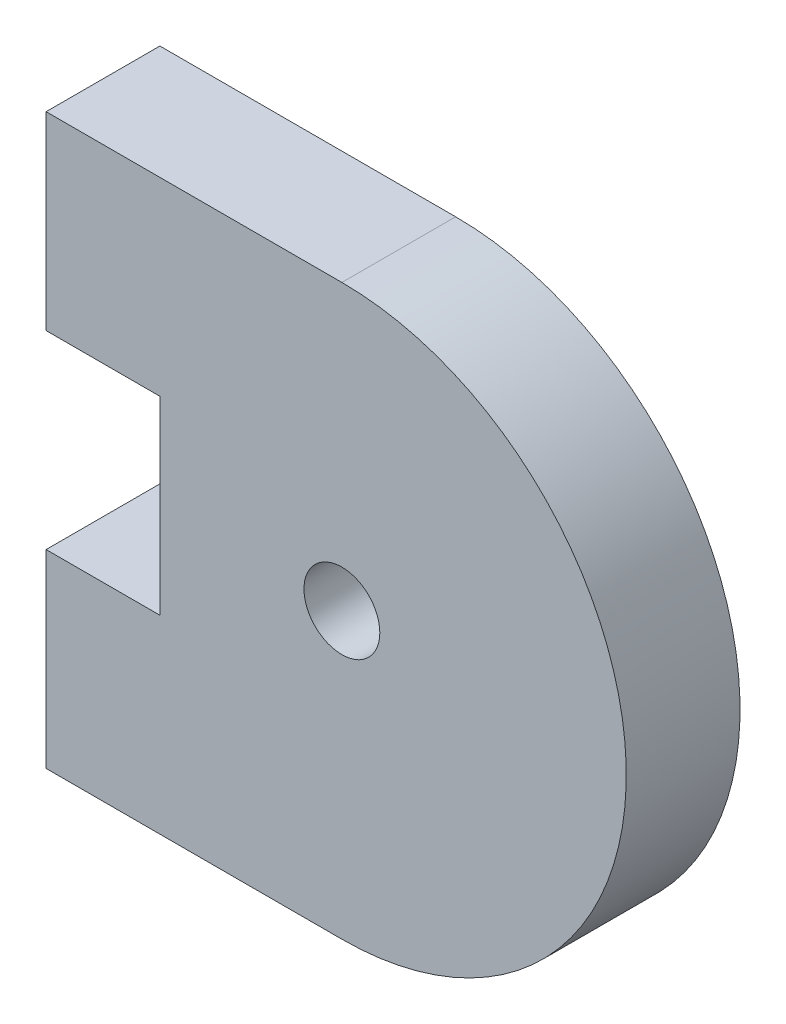
ISO-10303-21;
HEADER;
FILE_DESCRIPTION(('STEP AP214'),'2;1');
FILE_NAME('part.step','',(''),(''),'','','');
FILE_SCHEMA(('AUTOMOTIVE_DESIGN { 1 0 10303 214 1 1 1 1 }'));
ENDSEC;
DATA;
#1=APPLICATION_CONTEXT('core data for automotive mechanical design processes');
#2=APPLICATION_PROTOCOL_DEFINITION('international standard','automotive_design',2000,#1);
#3=PRODUCT_CONTEXT('',#1,'mechanical');
#4=PRODUCT('Part','Part','',(#3));
#5=PRODUCT_RELATED_PRODUCT_CATEGORY('part','',(#4));
#6=PRODUCT_DEFINITION_FORMATION('','',#4);
#7=PRODUCT_DEFINITION_CONTEXT('part definition',#1,'design');
#8=PRODUCT_DEFINITION('design','',#6,#7);
#9=PRODUCT_DEFINITION_SHAPE('','',#8);
#10=(LENGTH_UNIT() NAMED_UNIT(*) SI_UNIT(.MILLI.,.METRE.));
#11=(NAMED_UNIT(*) PLANE_ANGLE_UNIT() SI_UNIT($,.RADIAN.));
#12=(NAMED_UNIT(*) SI_UNIT($,.STERADIAN.) SOLID_ANGLE_UNIT());
#13=UNCERTAINTY_MEASURE_WITH_UNIT(LENGTH_MEASURE(1.E-05),#10,'distance_accuracy_value','');
#14=(GEOMETRIC_REPRESENTATION_CONTEXT(3) GLOBAL_UNCERTAINTY_ASSIGNED_CONTEXT((#13)) GLOBAL_UNIT_ASSIGNED_CONTEXT((#10,
#11,#12)) REPRESENTATION_CONTEXT('',''));
#15=CARTESIAN_POINT('',(0.,0.,0.));
#16=DIRECTION('',(0.,0.,1.));
#17=DIRECTION('',(1.,0.,0.));
#18=AXIS2_PLACEMENT_3D('',#15,#16,#17);
#19=CARTESIAN_POINT('',(42.3999999999994,42.378566682536,3.));
#20=DIRECTION('',(0.,0.,1.));
#21=DIRECTION('',(1.,0.,0.));
#22=AXIS2_PLACEMENT_3D('',#19,#20,#21);
#23=PLANE('',#22);
#24=CARTESIAN_POINT('',(42.3999999999994,42.378566682536,3.));
#25=DIRECTION('',(0.,0.,1.));
#26=DIRECTION('',(1.,0.,0.));
#27=AXIS2_PLACEMENT_3D('',#24,#25,#26);
#28=CIRCLE('',#27,7.50000000000006);
#29=CARTESIAN_POINT('',(42.3999999999994,34.8785666825359,3.));
#30=VERTEX_POINT('',#29);
#31=CARTESIAN_POINT('',(42.3999999999994,49.878566682536,3.));
#32=VERTEX_POINT('',#31);
#33=EDGE_CURVE('E145',#30,#32,#28,.T.);
#34=ORIENTED_EDGE('',*,*,#33,.T.);
#35=DIRECTION('',(-1.,0.,0.));
#36=VECTOR('',#35,1.);
#37=CARTESIAN_POINT('',(42.3999999999994,49.878566682536,3.));
#38=LINE('',#37,#36);
#39=CARTESIAN_POINT('',(34.5999999999994,49.8785666825361,3.));
#40=VERTEX_POINT('',#39);
#41=EDGE_CURVE('E93',#32,#40,#38,.T.);
#42=ORIENTED_EDGE('',*,*,#41,.T.);
#43=DIRECTION('',(0.,-1.,0.));
#44=VECTOR('',#43,1.);
#45=CARTESIAN_POINT('',(34.5999999999994,49.8785666825361,3.));
#46=LINE('',#45,#44);
#47=CARTESIAN_POINT('',(34.5999999999994,44.8785666825364,3.));
#48=VERTEX_POINT('',#47);
#49=EDGE_CURVE('E160',#40,#48,#46,.T.);
#50=ORIENTED_EDGE('',*,*,#49,.T.);
#51=DIRECTION('',(1.,0.,0.));
#52=VECTOR('',#51,1.);
#53=CARTESIAN_POINT('',(34.5999999999994,44.8785666825364,3.));
#54=LINE('',#53,#52);
#55=CARTESIAN_POINT('',(37.5999999999994,44.8785666825364,3.));
#56=VERTEX_POINT('',#55);
#57=EDGE_CURVE('E173',#48,#56,#54,.T.);
#58=ORIENTED_EDGE('',*,*,#57,.T.);
#59=DIRECTION('',(0.,-1.,0.));
#60=VECTOR('',#59,1.);
#61=CARTESIAN_POINT('',(37.5999999999994,44.8785666825364,3.));
#62=LINE('',#61,#60);
#63=CARTESIAN_POINT('',(37.5999999999994,39.878566682536,3.));
#64=VERTEX_POINT('',#63);
#65=EDGE_CURVE('E112',#56,#64,#62,.T.);
#66=ORIENTED_EDGE('',*,*,#65,.T.);
#67=DIRECTION('',(-1.,0.,0.));
#68=VECTOR('',#67,1.);
#69=CARTESIAN_POINT('',(37.5999999999994,39.878566682536,3.));
#70=LINE('',#69,#68);
#71=CARTESIAN_POINT('',(34.6000000000002,39.878566682536,3.));
#72=VERTEX_POINT('',#71);
#73=EDGE_CURVE('E106',#64,#72,#70,.T.);
#74=ORIENTED_EDGE('',*,*,#73,.T.);
#75=DIRECTION('',(0.,-1.,0.));
#76=VECTOR('',#75,1.);
#77=CARTESIAN_POINT('',(34.6000000000002,39.878566682536,3.));
#78=LINE('',#77,#76);
#79=CARTESIAN_POINT('',(34.6000000000002,34.878566682536,3.));
#80=VERTEX_POINT('',#79);
#81=EDGE_CURVE('E110',#72,#80,#78,.T.);
#82=ORIENTED_EDGE('',*,*,#81,.T.);
#83=DIRECTION('',(1.,0.,0.));
#84=VECTOR('',#83,1.);
#85=CARTESIAN_POINT('',(34.6000000000002,34.878566682536,3.));
#86=LINE('',#85,#84);
#87=EDGE_CURVE('E50',#80,#30,#86,.T.);
#88=ORIENTED_EDGE('',*,*,#87,.T.);
#89=EDGE_LOOP('',(#34,#42,#50,#58,#66,#74,#82,#88));
#90=FACE_BOUND('',#89,.T.);
#91=CARTESIAN_POINT('',(42.3999999999994,42.378566682536,3.));
#92=DIRECTION('',(0.,0.,1.));
#93=DIRECTION('',(1.,0.,0.));
#94=AXIS2_PLACEMENT_3D('',#91,#92,#93);
#95=CIRCLE('',#94,1.);
#96=CARTESIAN_POINT('',(43.3999999999994,42.378566682536,3.));
#97=VERTEX_POINT('',#96);
#98=EDGE_CURVE('E134',#97,#97,#95,.T.);
#99=ORIENTED_EDGE('',*,*,#98,.F.);
#100=EDGE_LOOP('',(#99));
#101=FACE_BOUND('',#100,.T.);
#102=ADVANCED_FACE('F33',(#90,#101),#23,.T.);
#103=CARTESIAN_POINT('',(42.3999999999994,42.378566682536,0.));
#104=DIRECTION('',(0.,0.,1.));
#105=DIRECTION('',(1.,0.,0.));
#106=AXIS2_PLACEMENT_3D('',#103,#104,#105);
#107=PLANE('',#106);
#108=CARTESIAN_POINT('',(42.3999999999994,42.378566682536,0.));
#109=DIRECTION('',(0.,0.,1.));
#110=DIRECTION('',(1.,0.,0.));
#111=AXIS2_PLACEMENT_3D('',#108,#109,#110);
#112=CIRCLE('',#111,7.50000000000006);
#113=CARTESIAN_POINT('',(42.3999999999994,34.8785666825359,0.));
#114=VERTEX_POINT('',#113);
#115=CARTESIAN_POINT('',(42.3999999999994,49.878566682536,0.));
#116=VERTEX_POINT('',#115);
#117=EDGE_CURVE('E130',#114,#116,#112,.T.);
#118=ORIENTED_EDGE('',*,*,#117,.F.);
#119=DIRECTION('',(1.,0.,0.));
#120=VECTOR('',#119,1.);
#121=CARTESIAN_POINT('',(34.6000000000002,34.878566682536,0.));
#122=LINE('',#121,#120);
#123=CARTESIAN_POINT('',(34.6000000000002,34.878566682536,0.));
#124=VERTEX_POINT('',#123);
#125=EDGE_CURVE('E85',#124,#114,#122,.T.);
#126=ORIENTED_EDGE('',*,*,#125,.F.);
#127=DIRECTION('',(0.,-1.,0.));
#128=VECTOR('',#127,1.);
#129=CARTESIAN_POINT('',(34.6000000000002,39.878566682536,0.));
#130=LINE('',#129,#128);
#131=CARTESIAN_POINT('',(34.6000000000002,39.878566682536,0.));
#132=VERTEX_POINT('',#131);
#133=EDGE_CURVE('E79',#132,#124,#130,.T.);
#134=ORIENTED_EDGE('',*,*,#133,.F.);
#135=DIRECTION('',(-1.,0.,0.));
#136=VECTOR('',#135,1.);
#137=CARTESIAN_POINT('',(37.5999999999994,39.878566682536,0.));
#138=LINE('',#137,#136);
#139=CARTESIAN_POINT('',(37.5999999999994,39.878566682536,0.));
#140=VERTEX_POINT('',#139);
#141=EDGE_CURVE('E120',#140,#132,#138,.T.);
#142=ORIENTED_EDGE('',*,*,#141,.F.);
#143=DIRECTION('',(0.,-1.,0.));
#144=VECTOR('',#143,1.);
#145=CARTESIAN_POINT('',(37.5999999999994,44.8785666825364,0.));
#146=LINE('',#145,#144);
#147=CARTESIAN_POINT('',(37.5999999999994,44.8785666825364,0.));
#148=VERTEX_POINT('',#147);
#149=EDGE_CURVE('E140',#148,#140,#146,.T.);
#150=ORIENTED_EDGE('',*,*,#149,.F.);
#151=DIRECTION('',(1.,0.,0.));
#152=VECTOR('',#151,1.);
#153=CARTESIAN_POINT('',(34.5999999999994,44.8785666825364,0.));
#154=LINE('',#153,#152);
#155=CARTESIAN_POINT('',(34.5999999999994,44.8785666825364,0.));
#156=VERTEX_POINT('',#155);
#157=EDGE_CURVE('E138',#156,#148,#154,.T.);
#158=ORIENTED_EDGE('',*,*,#157,.F.);
#159=DIRECTION('',(0.,-1.,0.));
#160=VECTOR('',#159,1.);
#161=CARTESIAN_POINT('',(34.5999999999994,49.8785666825361,0.));
#162=LINE('',#161,#160);
#163=CARTESIAN_POINT('',(34.5999999999994,49.8785666825361,0.));
#164=VERTEX_POINT('',#163);
#165=EDGE_CURVE('E136',#164,#156,#162,.T.);
#166=ORIENTED_EDGE('',*,*,#165,.F.);
#167=DIRECTION('',(-1.,0.,0.));
#168=VECTOR('',#167,1.);
#169=CARTESIAN_POINT('',(42.3999999999994,49.878566682536,0.));
#170=LINE('',#169,#168);
#171=EDGE_CURVE('E133',#116,#164,#170,.T.);
#172=ORIENTED_EDGE('',*,*,#171,.F.);
#173=EDGE_LOOP('',(#118,#126,#134,#142,#150,#158,#166,#172));
#174=FACE_BOUND('',#173,.T.);
#175=CARTESIAN_POINT('',(42.3999999999994,42.378566682536,0.));
#176=DIRECTION('',(0.,0.,1.));
#177=DIRECTION('',(1.,0.,0.));
#178=AXIS2_PLACEMENT_3D('',#175,#176,#177);
#179=CIRCLE('',#178,1.);
#180=CARTESIAN_POINT('',(43.3999999999994,42.378566682536,0.));
#181=VERTEX_POINT('',#180);
#182=EDGE_CURVE('E179',#181,#181,#179,.T.);
#183=ORIENTED_EDGE('',*,*,#182,.T.);
#184=EDGE_LOOP('',(#183));
#185=FACE_BOUND('',#184,.T.);
#186=ADVANCED_FACE('F164',(#174,#185),#107,.F.);
#187=CARTESIAN_POINT('',(42.3999999999994,42.378566682536,3.));
#188=DIRECTION('',(0.,0.,-1.));
#189=DIRECTION('',(-1.,0.,0.));
#190=AXIS2_PLACEMENT_3D('',#187,#188,#189);
#191=CYLINDRICAL_SURFACE('',#190,7.50000000000006);
#192=ORIENTED_EDGE('',*,*,#117,.T.);
#193=DIRECTION('',(0.,0.,-1.));
#194=VECTOR('',#193,1.);
#195=CARTESIAN_POINT('',(42.3999999999994,49.878566682536,3.));
#196=LINE('',#195,#194);
#197=EDGE_CURVE('E11',#32,#116,#196,.T.);
#198=ORIENTED_EDGE('',*,*,#197,.F.);
#199=ORIENTED_EDGE('',*,*,#33,.F.);
#200=DIRECTION('',(0.,0.,-1.));
#201=VECTOR('',#200,1.);
#202=CARTESIAN_POINT('',(42.3999999999994,34.8785666825359,3.));
#203=LINE('',#202,#201);
#204=EDGE_CURVE('E126',#30,#114,#203,.T.);
#205=ORIENTED_EDGE('',*,*,#204,.T.);
#206=EDGE_LOOP('',(#192,#198,#199,#205));
#207=FACE_BOUND('',#206,.T.);
#208=ADVANCED_FACE('F35',(#207),#191,.T.);
#209=CARTESIAN_POINT('',(42.3999999999994,49.878566682536,3.));
#210=DIRECTION('',(0.,-1.,0.));
#211=DIRECTION('',(1.,0.,0.));
#212=AXIS2_PLACEMENT_3D('',#209,#210,#211);
#213=PLANE('',#212);
#214=ORIENTED_EDGE('',*,*,#171,.T.);
#215=DIRECTION('',(0.,0.,-1.));
#216=VECTOR('',#215,1.);
#217=CARTESIAN_POINT('',(34.5999999999994,49.8785666825361,3.));
#218=LINE('',#217,#216);
#219=EDGE_CURVE('E42',#40,#164,#218,.T.);
#220=ORIENTED_EDGE('',*,*,#219,.F.);
#221=ORIENTED_EDGE('',*,*,#41,.F.);
#222=ORIENTED_EDGE('',*,*,#197,.T.);
#223=EDGE_LOOP('',(#214,#220,#221,#222));
#224=FACE_BOUND('',#223,.T.);
#225=ADVANCED_FACE('F207',(#224),#213,.F.);
#226=CARTESIAN_POINT('',(34.5999999999994,49.8785666825361,3.));
#227=DIRECTION('',(1.,0.,0.));
#228=DIRECTION('',(0.,0.,-1.));
#229=AXIS2_PLACEMENT_3D('',#226,#227,#228);
#230=PLANE('',#229);
#231=ORIENTED_EDGE('',*,*,#165,.T.);
#232=DIRECTION('',(0.,0.,-1.));
#233=VECTOR('',#232,1.);
#234=CARTESIAN_POINT('',(34.5999999999994,44.8785666825364,3.));
#235=LINE('',#234,#233);
#236=EDGE_CURVE('E152',#48,#156,#235,.T.);
#237=ORIENTED_EDGE('',*,*,#236,.F.);
#238=ORIENTED_EDGE('',*,*,#49,.F.);
#239=ORIENTED_EDGE('',*,*,#219,.T.);
#240=EDGE_LOOP('',(#231,#237,#238,#239));
#241=FACE_BOUND('',#240,.T.);
#242=ADVANCED_FACE('F158',(#241),#230,.F.);
#243=CARTESIAN_POINT('',(34.5999999999994,44.8785666825364,3.));
#244=DIRECTION('',(0.,1.,0.));
#245=DIRECTION('',(0.,0.,1.));
#246=AXIS2_PLACEMENT_3D('',#243,#244,#245);
#247=PLANE('',#246);
#248=ORIENTED_EDGE('',*,*,#157,.T.);
#249=DIRECTION('',(0.,0.,-1.));
#250=VECTOR('',#249,1.);
#251=CARTESIAN_POINT('',(37.5999999999994,44.8785666825364,3.));
#252=LINE('',#251,#250);
#253=EDGE_CURVE('E149',#56,#148,#252,.T.);
#254=ORIENTED_EDGE('',*,*,#253,.F.);
#255=ORIENTED_EDGE('',*,*,#57,.F.);
#256=ORIENTED_EDGE('',*,*,#236,.T.);
#257=EDGE_LOOP('',(#248,#254,#255,#256));
#258=FACE_BOUND('',#257,.T.);
#259=ADVANCED_FACE('F169',(#258),#247,.F.);
#260=CARTESIAN_POINT('',(37.5999999999994,44.8785666825364,3.));
#261=DIRECTION('',(1.,0.,0.));
#262=DIRECTION('',(0.,0.,-1.));
#263=AXIS2_PLACEMENT_3D('',#260,#261,#262);
#264=PLANE('',#263);
#265=ORIENTED_EDGE('',*,*,#149,.T.);
#266=DIRECTION('',(0.,0.,-1.));
#267=VECTOR('',#266,1.);
#268=CARTESIAN_POINT('',(37.5999999999994,39.878566682536,3.));
#269=LINE('',#268,#267);
#270=EDGE_CURVE('E121',#64,#140,#269,.T.);
#271=ORIENTED_EDGE('',*,*,#270,.F.);
#272=ORIENTED_EDGE('',*,*,#65,.F.);
#273=ORIENTED_EDGE('',*,*,#253,.T.);
#274=EDGE_LOOP('',(#265,#271,#272,#273));
#275=FACE_BOUND('',#274,.T.);
#276=ADVANCED_FACE('F172',(#275),#264,.F.);
#277=CARTESIAN_POINT('',(37.5999999999994,39.878566682536,3.));
#278=DIRECTION('',(0.,-1.,0.));
#279=DIRECTION('',(0.,0.,-1.));
#280=AXIS2_PLACEMENT_3D('',#277,#278,#279);
#281=PLANE('',#280);
#282=ORIENTED_EDGE('',*,*,#141,.T.);
#283=DIRECTION('',(0.,0.,-1.));
#284=VECTOR('',#283,1.);
#285=CARTESIAN_POINT('',(34.6000000000002,39.878566682536,3.));
#286=LINE('',#285,#284);
#287=EDGE_CURVE('E117',#72,#132,#286,.T.);
#288=ORIENTED_EDGE('',*,*,#287,.F.);
#289=ORIENTED_EDGE('',*,*,#73,.F.);
#290=ORIENTED_EDGE('',*,*,#270,.T.);
#291=EDGE_LOOP('',(#282,#288,#289,#290));
#292=FACE_BOUND('',#291,.T.);
#293=ADVANCED_FACE('F118',(#292),#281,.F.);
#294=CARTESIAN_POINT('',(34.6000000000002,39.878566682536,3.));
#295=DIRECTION('',(1.,0.,0.));
#296=DIRECTION('',(0.,0.,-1.));
#297=AXIS2_PLACEMENT_3D('',#294,#295,#296);
#298=PLANE('',#297);
#299=ORIENTED_EDGE('',*,*,#133,.T.);
#300=DIRECTION('',(0.,0.,-1.));
#301=VECTOR('',#300,1.);
#302=CARTESIAN_POINT('',(34.6000000000002,34.878566682536,3.));
#303=LINE('',#302,#301);
#304=EDGE_CURVE('E122',#80,#124,#303,.T.);
#305=ORIENTED_EDGE('',*,*,#304,.F.);
#306=ORIENTED_EDGE('',*,*,#81,.F.);
#307=ORIENTED_EDGE('',*,*,#287,.T.);
#308=EDGE_LOOP('',(#299,#305,#306,#307));
#309=FACE_BOUND('',#308,.T.);
#310=ADVANCED_FACE('F124',(#309),#298,.F.);
#311=CARTESIAN_POINT('',(34.6000000000002,34.878566682536,3.));
#312=DIRECTION('',(0.,1.,0.));
#313=DIRECTION('',(-1.,0.,0.));
#314=AXIS2_PLACEMENT_3D('',#311,#312,#313);
#315=PLANE('',#314);
#316=ORIENTED_EDGE('',*,*,#125,.T.);
#317=ORIENTED_EDGE('',*,*,#204,.F.);
#318=ORIENTED_EDGE('',*,*,#87,.F.);
#319=ORIENTED_EDGE('',*,*,#304,.T.);
#320=EDGE_LOOP('',(#316,#317,#318,#319));
#321=FACE_BOUND('',#320,.T.);
#322=ADVANCED_FACE('F195',(#321),#315,.F.);
#323=CARTESIAN_POINT('',(42.3999999999994,42.378566682536,3.));
#324=DIRECTION('',(0.,0.,-1.));
#325=DIRECTION('',(-1.,0.,0.));
#326=AXIS2_PLACEMENT_3D('',#323,#324,#325);
#327=CYLINDRICAL_SURFACE('',#326,1.);
#328=ORIENTED_EDGE('',*,*,#98,.T.);
#329=EDGE_LOOP('',(#328));
#330=FACE_BOUND('',#329,.T.);
#331=ORIENTED_EDGE('',*,*,#182,.F.);
#332=EDGE_LOOP('',(#331));
#333=FACE_BOUND('',#332,.T.);
#334=ADVANCED_FACE('F185',(#330,#333),#327,.F.);
#335=CLOSED_SHELL('',(#102,#186,#208,#225,#242,#259,#276,#293,#310,#322,#334));
#336=MANIFOLD_SOLID_BREP('B2',#335);
#337=ADVANCED_BREP_SHAPE_REPRESENTATION('',(#18,#336),#14);
#338=SHAPE_DEFINITION_REPRESENTATION(#9,#337);
ENDSEC;
END-ISO-10303-21;
